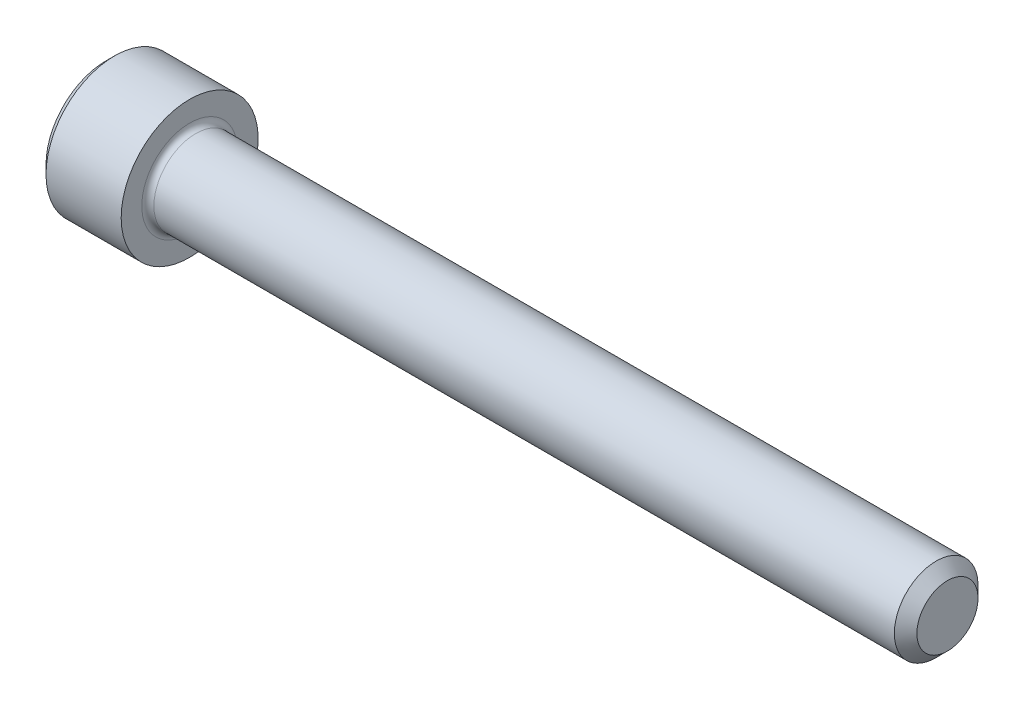
ISO-10303-21;
HEADER;
FILE_DESCRIPTION(('STEP AP214'),'2;1');
FILE_NAME('part.step','',(''),(''),'','','');
FILE_SCHEMA(('AUTOMOTIVE_DESIGN { 1 0 10303 214 1 1 1 1 }'));
ENDSEC;
DATA;
#1=APPLICATION_CONTEXT('core data for automotive mechanical design processes');
#2=APPLICATION_PROTOCOL_DEFINITION('international standard','automotive_design',2000,#1);
#3=PRODUCT_CONTEXT('',#1,'mechanical');
#4=PRODUCT('Part','Part','',(#3));
#5=PRODUCT_RELATED_PRODUCT_CATEGORY('part','',(#4));
#6=PRODUCT_DEFINITION_FORMATION('','',#4);
#7=PRODUCT_DEFINITION_CONTEXT('part definition',#1,'design');
#8=PRODUCT_DEFINITION('design','',#6,#7);
#9=PRODUCT_DEFINITION_SHAPE('','',#8);
#10=(LENGTH_UNIT() NAMED_UNIT(*) SI_UNIT(.MILLI.,.METRE.));
#11=(NAMED_UNIT(*) PLANE_ANGLE_UNIT() SI_UNIT($,.RADIAN.));
#12=(NAMED_UNIT(*) SI_UNIT($,.STERADIAN.) SOLID_ANGLE_UNIT());
#13=UNCERTAINTY_MEASURE_WITH_UNIT(LENGTH_MEASURE(1.E-05),#10,'distance_accuracy_value','');
#14=(GEOMETRIC_REPRESENTATION_CONTEXT(3) GLOBAL_UNCERTAINTY_ASSIGNED_CONTEXT((#13)) GLOBAL_UNIT_ASSIGNED_CONTEXT((#10,
#11,#12)) REPRESENTATION_CONTEXT('',''));
#15=CARTESIAN_POINT('',(0.,0.,0.));
#16=DIRECTION('',(0.,0.,1.));
#17=DIRECTION('',(1.,0.,0.));
#18=AXIS2_PLACEMENT_3D('',#15,#16,#17);
#19=CARTESIAN_POINT('',(0.,0.,0.));
#20=DIRECTION('',(-1.,0.,0.));
#21=DIRECTION('',(0.,0.,1.));
#22=AXIS2_PLACEMENT_3D('',#19,#20,#21);
#23=PLANE('',#22);
#24=DIRECTION('',(0.,-0.499999999999999,0.866025403784439));
#25=VECTOR('',#24,1.);
#26=CARTESIAN_POINT('',(0.,1.5984519552784,0.));
#27=LINE('',#26,#25);
#28=CARTESIAN_POINT('',(0.,1.5984519552784,0.));
#29=VERTEX_POINT('',#28);
#30=CARTESIAN_POINT('',(0.,0.799225977639205,1.3843));
#31=VERTEX_POINT('',#30);
#32=EDGE_CURVE('E384',#29,#31,#27,.T.);
#33=ORIENTED_EDGE('',*,*,#32,.T.);
#34=DIRECTION('',(0.,1.,0.));
#35=VECTOR('',#34,1.);
#36=CARTESIAN_POINT('',(0.,-0.799225977639191,1.3843));
#37=LINE('',#36,#35);
#38=CARTESIAN_POINT('',(0.,-0.799225977639191,1.3843));
#39=VERTEX_POINT('',#38);
#40=EDGE_CURVE('E128',#39,#31,#37,.T.);
#41=ORIENTED_EDGE('',*,*,#40,.F.);
#42=DIRECTION('',(0.,-0.500000000000001,-0.866025403784438));
#43=VECTOR('',#42,1.);
#44=CARTESIAN_POINT('',(0.,-0.799225977639191,1.3843));
#45=LINE('',#44,#43);
#46=CARTESIAN_POINT('',(0.,-1.59845195527839,0.));
#47=VERTEX_POINT('',#46);
#48=EDGE_CURVE('E387',#39,#47,#45,.T.);
#49=ORIENTED_EDGE('',*,*,#48,.T.);
#50=DIRECTION('',(0.,0.499999999999999,-0.86602540378444));
#51=VECTOR('',#50,1.);
#52=CARTESIAN_POINT('',(0.,-1.59845195527839,0.));
#53=LINE('',#52,#51);
#54=CARTESIAN_POINT('',(0.,-0.799225977639196,-1.3843));
#55=VERTEX_POINT('',#54);
#56=EDGE_CURVE('E390',#47,#55,#53,.T.);
#57=ORIENTED_EDGE('',*,*,#56,.T.);
#58=DIRECTION('',(0.,-1.,0.));
#59=VECTOR('',#58,1.);
#60=CARTESIAN_POINT('',(0.,0.799225977639202,-1.3843));
#61=LINE('',#60,#59);
#62=CARTESIAN_POINT('',(0.,0.799225977639202,-1.3843));
#63=VERTEX_POINT('',#62);
#64=EDGE_CURVE('E393',#63,#55,#61,.T.);
#65=ORIENTED_EDGE('',*,*,#64,.F.);
#66=DIRECTION('',(0.,-0.500000000000001,-0.866025403784438));
#67=VECTOR('',#66,1.);
#68=CARTESIAN_POINT('',(0.,1.5984519552784,0.));
#69=LINE('',#68,#67);
#70=EDGE_CURVE('E123',#29,#63,#69,.T.);
#71=ORIENTED_EDGE('',*,*,#70,.F.);
#72=EDGE_LOOP('',(#33,#41,#49,#57,#65,#71));
#73=FACE_BOUND('',#72,.T.);
#74=CARTESIAN_POINT('',(0.,0.,0.));
#75=DIRECTION('',(-1.,0.,0.));
#76=DIRECTION('',(0.,0.,1.));
#77=AXIS2_PLACEMENT_3D('',#74,#75,#76);
#78=CIRCLE('',#77,2.51460000000001);
#79=CARTESIAN_POINT('',(0.,0.,2.51460000000001));
#80=VERTEX_POINT('',#79);
#81=EDGE_CURVE('E139',#80,#80,#78,.T.);
#82=ORIENTED_EDGE('',*,*,#81,.T.);
#83=EDGE_LOOP('',(#82));
#84=FACE_BOUND('',#83,.T.);
#85=ADVANCED_FACE('F32',(#73,#84),#23,.T.);
#86=CARTESIAN_POINT('',(35.2552,1.28016,0.));
#87=DIRECTION('',(1.,0.,0.));
#88=DIRECTION('',(0.,0.,-1.));
#89=AXIS2_PLACEMENT_3D('',#86,#87,#88);
#90=PLANE('',#89);
#91=CARTESIAN_POINT('',(35.2552,0.,0.));
#92=DIRECTION('',(-1.,0.,0.));
#93=DIRECTION('',(0.,0.,1.));
#94=AXIS2_PLACEMENT_3D('',#91,#92,#93);
#95=CIRCLE('',#94,1.28016);
#96=CARTESIAN_POINT('',(35.2552,0.,1.28016));
#97=VERTEX_POINT('',#96);
#98=EDGE_CURVE('E152',#97,#97,#95,.T.);
#99=ORIENTED_EDGE('',*,*,#98,.F.);
#100=EDGE_LOOP('',(#99));
#101=FACE_BOUND('',#100,.T.);
#102=ADVANCED_FACE('F173',(#101),#90,.T.);
#103=CARTESIAN_POINT('',(35.2552,0.,0.));
#104=DIRECTION('',(-1.,0.,0.));
#105=DIRECTION('',(0.,0.,1.));
#106=AXIS2_PLACEMENT_3D('',#103,#104,#105);
#107=CONICAL_SURFACE('',#106,1.28016,0.785398163397457);
#108=CARTESIAN_POINT('',(34.78276,0.,0.));
#109=DIRECTION('',(-1.,0.,0.));
#110=DIRECTION('',(0.,0.,1.));
#111=AXIS2_PLACEMENT_3D('',#108,#109,#110);
#112=CIRCLE('',#111,1.7526);
#113=CARTESIAN_POINT('',(34.78276,0.,1.7526));
#114=VERTEX_POINT('',#113);
#115=EDGE_CURVE('E149',#114,#114,#112,.T.);
#116=ORIENTED_EDGE('',*,*,#115,.F.);
#117=EDGE_LOOP('',(#116));
#118=FACE_BOUND('',#117,.T.);
#119=ORIENTED_EDGE('',*,*,#98,.T.);
#120=EDGE_LOOP('',(#119));
#121=FACE_BOUND('',#120,.T.);
#122=ADVANCED_FACE('F179',(#118,#121),#107,.T.);
#123=CARTESIAN_POINT('',(-31.75,0.,0.));
#124=DIRECTION('',(-1.,0.,0.));
#125=DIRECTION('',(0.,0.,1.));
#126=AXIS2_PLACEMENT_3D('',#123,#124,#125);
#127=CYLINDRICAL_SURFACE('',#126,1.7526);
#128=CARTESIAN_POINT('',(3.7592,0.,0.));
#129=DIRECTION('',(1.,0.,0.));
#130=DIRECTION('',(0.,0.,-1.));
#131=AXIS2_PLACEMENT_3D('',#128,#129,#130);
#132=CIRCLE('',#131,1.7526);
#133=CARTESIAN_POINT('',(3.7592,0.,-1.7526));
#134=VERTEX_POINT('',#133);
#135=EDGE_CURVE('E11',#134,#134,#132,.T.);
#136=ORIENTED_EDGE('',*,*,#135,.T.);
#137=EDGE_LOOP('',(#136));
#138=FACE_BOUND('',#137,.T.);
#139=ORIENTED_EDGE('',*,*,#115,.T.);
#140=EDGE_LOOP('',(#139));
#141=FACE_BOUND('',#140,.T.);
#142=ADVANCED_FACE('F190',(#138,#141),#127,.T.);
#143=CARTESIAN_POINT('',(3.5052,2.8702,0.));
#144=DIRECTION('',(1.,0.,0.));
#145=DIRECTION('',(0.,0.,-1.));
#146=AXIS2_PLACEMENT_3D('',#143,#144,#145);
#147=PLANE('',#146);
#148=CARTESIAN_POINT('',(3.5052,0.,0.));
#149=DIRECTION('',(1.,0.,0.));
#150=DIRECTION('',(0.,0.,-1.));
#151=AXIS2_PLACEMENT_3D('',#148,#149,#150);
#152=CIRCLE('',#151,2.0066);
#153=CARTESIAN_POINT('',(3.5052,0.,-2.0066));
#154=VERTEX_POINT('',#153);
#155=EDGE_CURVE('E40',#154,#154,#152,.F.);
#156=ORIENTED_EDGE('',*,*,#155,.T.);
#157=EDGE_LOOP('',(#156));
#158=FACE_BOUND('',#157,.T.);
#159=CARTESIAN_POINT('',(3.5052,0.,0.));
#160=DIRECTION('',(-1.,0.,0.));
#161=DIRECTION('',(0.,0.,1.));
#162=AXIS2_PLACEMENT_3D('',#159,#160,#161);
#163=CIRCLE('',#162,2.8702);
#164=CARTESIAN_POINT('',(3.5052,0.,2.8702));
#165=VERTEX_POINT('',#164);
#166=EDGE_CURVE('E146',#165,#165,#163,.T.);
#167=ORIENTED_EDGE('',*,*,#166,.F.);
#168=EDGE_LOOP('',(#167));
#169=FACE_BOUND('',#168,.T.);
#170=ADVANCED_FACE('F157',(#158,#169),#147,.T.);
#171=CARTESIAN_POINT('',(-31.75,0.,0.));
#172=DIRECTION('',(-1.,0.,0.));
#173=DIRECTION('',(0.,0.,1.));
#174=AXIS2_PLACEMENT_3D('',#171,#172,#173);
#175=CYLINDRICAL_SURFACE('',#174,2.8702);
#176=ORIENTED_EDGE('',*,*,#166,.T.);
#177=EDGE_LOOP('',(#176));
#178=FACE_BOUND('',#177,.T.);
#179=CARTESIAN_POINT('',(0.355600000000005,0.,0.));
#180=DIRECTION('',(-1.,0.,0.));
#181=DIRECTION('',(0.,0.,1.));
#182=AXIS2_PLACEMENT_3D('',#179,#180,#181);
#183=CIRCLE('',#182,2.8702);
#184=CARTESIAN_POINT('',(0.355600000000005,0.,2.8702));
#185=VERTEX_POINT('',#184);
#186=EDGE_CURVE('E143',#185,#185,#183,.T.);
#187=ORIENTED_EDGE('',*,*,#186,.F.);
#188=EDGE_LOOP('',(#187));
#189=FACE_BOUND('',#188,.T.);
#190=ADVANCED_FACE('F168',(#178,#189),#175,.T.);
#191=CARTESIAN_POINT('',(0.,0.,0.));
#192=DIRECTION('',(1.,0.,0.));
#193=DIRECTION('',(0.,0.,-1.));
#194=AXIS2_PLACEMENT_3D('',#191,#192,#193);
#195=CONICAL_SURFACE('',#194,2.51460000000001,0.785398163397436);
#196=ORIENTED_EDGE('',*,*,#186,.T.);
#197=EDGE_LOOP('',(#196));
#198=FACE_BOUND('',#197,.T.);
#199=ORIENTED_EDGE('',*,*,#81,.F.);
#200=EDGE_LOOP('',(#199));
#201=FACE_BOUND('',#200,.T.);
#202=ADVANCED_FACE('F161',(#198,#201),#195,.T.);
#203=CARTESIAN_POINT('',(3.7592,0.,0.));
#204=DIRECTION('',(1.,0.,0.));
#205=DIRECTION('',(0.,0.,-1.));
#206=AXIS2_PLACEMENT_3D('',#203,#204,#205);
#207=TOROIDAL_SURFACE('',#206,2.0066,0.254);
#208=ORIENTED_EDGE('',*,*,#135,.F.);
#209=EDGE_LOOP('',(#208));
#210=FACE_BOUND('',#209,.T.);
#211=ORIENTED_EDGE('',*,*,#155,.F.);
#212=EDGE_LOOP('',(#211));
#213=FACE_BOUND('',#212,.T.);
#214=ADVANCED_FACE('F34',(#210,#213),#207,.F.);
#215=CARTESIAN_POINT('',(1.6256,1.5984519552784,0.));
#216=DIRECTION('',(0.,-0.866025403784439,-0.499999999999999));
#217=DIRECTION('',(0.,0.499999999999999,-0.866025403784439));
#218=AXIS2_PLACEMENT_3D('',#215,#216,#217);
#219=PLANE('',#218);
#220=ORIENTED_EDGE('',*,*,#32,.F.);
#221=DIRECTION('',(-1.,0.,0.));
#222=VECTOR('',#221,1.);
#223=CARTESIAN_POINT('',(1.6256,1.5984519552784,0.));
#224=LINE('',#223,#222);
#225=CARTESIAN_POINT('',(1.6256,1.5984519552784,0.));
#226=VERTEX_POINT('',#225);
#227=EDGE_CURVE('E374',#226,#29,#224,.T.);
#228=ORIENTED_EDGE('',*,*,#227,.F.);
#229=DIRECTION('',(0.,-0.499999999999999,0.866025403784439));
#230=VECTOR('',#229,1.);
#231=CARTESIAN_POINT('',(1.6256,1.5984519552784,0.));
#232=LINE('',#231,#230);
#233=CARTESIAN_POINT('',(1.6256,1.1988389664588,0.692150000000001));
#234=VERTEX_POINT('',#233);
#235=EDGE_CURVE('E115',#226,#234,#232,.T.);
#236=ORIENTED_EDGE('',*,*,#235,.T.);
#237=CARTESIAN_POINT('',(1.6256,0.799225977639205,1.3843));
#238=VERTEX_POINT('',#237);
#239=EDGE_CURVE('E106',#234,#238,#232,.T.);
#240=ORIENTED_EDGE('',*,*,#239,.T.);
#241=DIRECTION('',(-1.,0.,0.));
#242=VECTOR('',#241,1.);
#243=CARTESIAN_POINT('',(1.6256,0.799225977639205,1.3843));
#244=LINE('',#243,#242);
#245=EDGE_CURVE('E120',#238,#31,#244,.T.);
#246=ORIENTED_EDGE('',*,*,#245,.T.);
#247=EDGE_LOOP('',(#220,#228,#236,#240,#246));
#248=FACE_BOUND('',#247,.T.);
#249=ADVANCED_FACE('F119',(#248),#219,.T.);
#250=CARTESIAN_POINT('',(1.6256,-0.799225977639191,1.3843));
#251=DIRECTION('',(0.,0.,1.));
#252=DIRECTION('',(0.,-1.,0.));
#253=AXIS2_PLACEMENT_3D('',#250,#251,#252);
#254=PLANE('',#253);
#255=ORIENTED_EDGE('',*,*,#40,.T.);
#256=ORIENTED_EDGE('',*,*,#245,.F.);
#257=DIRECTION('',(0.,1.,0.));
#258=VECTOR('',#257,1.);
#259=CARTESIAN_POINT('',(1.6256,-0.799225977639191,1.3843));
#260=LINE('',#259,#258);
#261=CARTESIAN_POINT('',(1.6256,0.,1.3843));
#262=VERTEX_POINT('',#261);
#263=EDGE_CURVE('E103',#262,#238,#260,.T.);
#264=ORIENTED_EDGE('',*,*,#263,.F.);
#265=CARTESIAN_POINT('',(1.6256,-0.799225977639191,1.3843));
#266=VERTEX_POINT('',#265);
#267=EDGE_CURVE('E114',#266,#262,#260,.T.);
#268=ORIENTED_EDGE('',*,*,#267,.F.);
#269=DIRECTION('',(-1.,0.,0.));
#270=VECTOR('',#269,1.);
#271=CARTESIAN_POINT('',(1.6256,-0.799225977639191,1.3843));
#272=LINE('',#271,#270);
#273=EDGE_CURVE('E130',#266,#39,#272,.T.);
#274=ORIENTED_EDGE('',*,*,#273,.T.);
#275=EDGE_LOOP('',(#255,#256,#264,#268,#274));
#276=FACE_BOUND('',#275,.T.);
#277=ADVANCED_FACE('F125',(#276),#254,.F.);
#278=CARTESIAN_POINT('',(1.6256,-0.799225977639191,1.3843));
#279=DIRECTION('',(0.,0.866025403784438,-0.500000000000001));
#280=DIRECTION('',(0.,0.500000000000001,0.866025403784438));
#281=AXIS2_PLACEMENT_3D('',#278,#279,#280);
#282=PLANE('',#281);
#283=ORIENTED_EDGE('',*,*,#48,.F.);
#284=ORIENTED_EDGE('',*,*,#273,.F.);
#285=DIRECTION('',(0.,-0.500000000000001,-0.866025403784438));
#286=VECTOR('',#285,1.);
#287=CARTESIAN_POINT('',(1.6256,-0.799225977639191,1.3843));
#288=LINE('',#287,#286);
#289=CARTESIAN_POINT('',(1.6256,-1.19883896645879,0.692149999999999));
#290=VERTEX_POINT('',#289);
#291=EDGE_CURVE('E413',#266,#290,#288,.T.);
#292=ORIENTED_EDGE('',*,*,#291,.T.);
#293=CARTESIAN_POINT('',(1.6256,-1.59845195527839,0.));
#294=VERTEX_POINT('',#293);
#295=EDGE_CURVE('E402',#290,#294,#288,.T.);
#296=ORIENTED_EDGE('',*,*,#295,.T.);
#297=DIRECTION('',(-1.,0.,0.));
#298=VECTOR('',#297,1.);
#299=CARTESIAN_POINT('',(1.6256,-1.59845195527839,0.));
#300=LINE('',#299,#298);
#301=EDGE_CURVE('E135',#294,#47,#300,.T.);
#302=ORIENTED_EDGE('',*,*,#301,.T.);
#303=EDGE_LOOP('',(#283,#284,#292,#296,#302));
#304=FACE_BOUND('',#303,.T.);
#305=ADVANCED_FACE('F265',(#304),#282,.T.);
#306=CARTESIAN_POINT('',(1.6256,-1.59845195527839,0.));
#307=DIRECTION('',(0.,0.866025403784439,0.499999999999999));
#308=DIRECTION('',(0.,-0.499999999999999,0.866025403784439));
#309=AXIS2_PLACEMENT_3D('',#306,#307,#308);
#310=PLANE('',#309);
#311=ORIENTED_EDGE('',*,*,#56,.F.);
#312=ORIENTED_EDGE('',*,*,#301,.F.);
#313=DIRECTION('',(0.,0.499999999999999,-0.86602540378444));
#314=VECTOR('',#313,1.);
#315=CARTESIAN_POINT('',(1.6256,-1.59845195527839,0.));
#316=LINE('',#315,#314);
#317=CARTESIAN_POINT('',(1.6256,-1.1988389664588,-0.692149999999996));
#318=VERTEX_POINT('',#317);
#319=EDGE_CURVE('E380',#294,#318,#316,.T.);
#320=ORIENTED_EDGE('',*,*,#319,.T.);
#321=CARTESIAN_POINT('',(1.6256,-0.799225977639196,-1.3843));
#322=VERTEX_POINT('',#321);
#323=EDGE_CURVE('E412',#318,#322,#316,.T.);
#324=ORIENTED_EDGE('',*,*,#323,.T.);
#325=DIRECTION('',(-1.,0.,0.));
#326=VECTOR('',#325,1.);
#327=CARTESIAN_POINT('',(1.6256,-0.799225977639196,-1.3843));
#328=LINE('',#327,#326);
#329=EDGE_CURVE('E373',#322,#55,#328,.T.);
#330=ORIENTED_EDGE('',*,*,#329,.T.);
#331=EDGE_LOOP('',(#311,#312,#320,#324,#330));
#332=FACE_BOUND('',#331,.T.);
#333=ADVANCED_FACE('F273',(#332),#310,.T.);
#334=CARTESIAN_POINT('',(1.6256,0.799225977639202,-1.3843));
#335=DIRECTION('',(0.,0.,-1.));
#336=DIRECTION('',(0.,1.,0.));
#337=AXIS2_PLACEMENT_3D('',#334,#335,#336);
#338=PLANE('',#337);
#339=ORIENTED_EDGE('',*,*,#64,.T.);
#340=ORIENTED_EDGE('',*,*,#329,.F.);
#341=DIRECTION('',(0.,-1.,0.));
#342=VECTOR('',#341,1.);
#343=CARTESIAN_POINT('',(1.6256,0.799225977639202,-1.3843));
#344=LINE('',#343,#342);
#345=CARTESIAN_POINT('',(1.6256,0.,-1.3843));
#346=VERTEX_POINT('',#345);
#347=EDGE_CURVE('E377',#346,#322,#344,.T.);
#348=ORIENTED_EDGE('',*,*,#347,.F.);
#349=CARTESIAN_POINT('',(1.6256,0.799225977639202,-1.3843));
#350=VERTEX_POINT('',#349);
#351=EDGE_CURVE('E47',#350,#346,#344,.T.);
#352=ORIENTED_EDGE('',*,*,#351,.F.);
#353=DIRECTION('',(-1.,0.,0.));
#354=VECTOR('',#353,1.);
#355=CARTESIAN_POINT('',(1.6256,0.799225977639202,-1.3843));
#356=LINE('',#355,#354);
#357=EDGE_CURVE('E370',#350,#63,#356,.T.);
#358=ORIENTED_EDGE('',*,*,#357,.T.);
#359=EDGE_LOOP('',(#339,#340,#348,#352,#358));
#360=FACE_BOUND('',#359,.T.);
#361=ADVANCED_FACE('F282',(#360),#338,.F.);
#362=CARTESIAN_POINT('',(1.6256,1.5984519552784,0.));
#363=DIRECTION('',(0.,0.866025403784438,-0.500000000000001));
#364=DIRECTION('',(0.,0.500000000000001,0.866025403784438));
#365=AXIS2_PLACEMENT_3D('',#362,#363,#364);
#366=PLANE('',#365);
#367=ORIENTED_EDGE('',*,*,#70,.T.);
#368=ORIENTED_EDGE('',*,*,#357,.F.);
#369=DIRECTION('',(0.,-0.500000000000001,-0.866025403784438));
#370=VECTOR('',#369,1.);
#371=CARTESIAN_POINT('',(1.6256,1.5984519552784,0.));
#372=LINE('',#371,#370);
#373=CARTESIAN_POINT('',(1.6256,1.1988389664588,-0.692150000000004));
#374=VERTEX_POINT('',#373);
#375=EDGE_CURVE('E360',#374,#350,#372,.T.);
#376=ORIENTED_EDGE('',*,*,#375,.F.);
#377=EDGE_CURVE('E366',#226,#374,#372,.T.);
#378=ORIENTED_EDGE('',*,*,#377,.F.);
#379=ORIENTED_EDGE('',*,*,#227,.T.);
#380=EDGE_LOOP('',(#367,#368,#376,#378,#379));
#381=FACE_BOUND('',#380,.T.);
#382=ADVANCED_FACE('F291',(#381),#366,.F.);
#383=CARTESIAN_POINT('',(1.6256,0.,2.7686));
#384=DIRECTION('',(1.,0.,0.));
#385=DIRECTION('',(0.,0.,-1.));
#386=AXIS2_PLACEMENT_3D('',#383,#384,#385);
#387=PLANE('',#386);
#388=ORIENTED_EDGE('',*,*,#347,.T.);
#389=ORIENTED_EDGE('',*,*,#323,.F.);
#390=CARTESIAN_POINT('',(1.6256,0.,0.));
#391=DIRECTION('',(-1.,0.,0.));
#392=DIRECTION('',(0.,0.,1.));
#393=AXIS2_PLACEMENT_3D('',#390,#391,#392);
#394=CIRCLE('',#393,1.3843);
#395=EDGE_CURVE('E408',#346,#318,#394,.T.);
#396=ORIENTED_EDGE('',*,*,#395,.F.);
#397=EDGE_LOOP('',(#388,#389,#396));
#398=FACE_BOUND('',#397,.T.);
#399=ADVANCED_FACE('F300',(#398),#387,.F.);
#400=ORIENTED_EDGE('',*,*,#319,.F.);
#401=ORIENTED_EDGE('',*,*,#295,.F.);
#402=EDGE_CURVE('E133',#318,#290,#394,.T.);
#403=ORIENTED_EDGE('',*,*,#402,.F.);
#404=EDGE_LOOP('',(#400,#401,#403));
#405=FACE_BOUND('',#404,.T.);
#406=ADVANCED_FACE('F309',(#405),#387,.F.);
#407=ORIENTED_EDGE('',*,*,#291,.F.);
#408=ORIENTED_EDGE('',*,*,#267,.T.);
#409=EDGE_CURVE('E129',#290,#262,#394,.T.);
#410=ORIENTED_EDGE('',*,*,#409,.F.);
#411=EDGE_LOOP('',(#407,#408,#410));
#412=FACE_BOUND('',#411,.T.);
#413=ADVANCED_FACE('F318',(#412),#387,.F.);
#414=ORIENTED_EDGE('',*,*,#263,.T.);
#415=ORIENTED_EDGE('',*,*,#239,.F.);
#416=EDGE_CURVE('E109',#262,#234,#394,.T.);
#417=ORIENTED_EDGE('',*,*,#416,.F.);
#418=EDGE_LOOP('',(#414,#415,#417));
#419=FACE_BOUND('',#418,.T.);
#420=ADVANCED_FACE('F105',(#419),#387,.F.);
#421=ORIENTED_EDGE('',*,*,#235,.F.);
#422=ORIENTED_EDGE('',*,*,#377,.T.);
#423=EDGE_CURVE('E140',#234,#374,#394,.T.);
#424=ORIENTED_EDGE('',*,*,#423,.F.);
#425=EDGE_LOOP('',(#421,#422,#424));
#426=FACE_BOUND('',#425,.T.);
#427=ADVANCED_FACE('F333',(#426),#387,.F.);
#428=ORIENTED_EDGE('',*,*,#375,.T.);
#429=ORIENTED_EDGE('',*,*,#351,.T.);
#430=EDGE_CURVE('E363',#374,#346,#394,.T.);
#431=ORIENTED_EDGE('',*,*,#430,.F.);
#432=EDGE_LOOP('',(#428,#429,#431));
#433=FACE_BOUND('',#432,.T.);
#434=ADVANCED_FACE('F248',(#433),#387,.F.);
#435=CARTESIAN_POINT('',(1.6256,0.,0.));
#436=DIRECTION('',(-1.,0.,0.));
#437=DIRECTION('',(0.,0.,1.));
#438=AXIS2_PLACEMENT_3D('',#435,#436,#437);
#439=CONICAL_SURFACE('',#438,1.3843,1.04719755119659);
#440=CARTESIAN_POINT('',(2.4248259776392,0.,0.));
#441=VERTEX_POINT('',#440);
#442=VERTEX_LOOP('',#441);
#443=FACE_BOUND('',#442,.T.);
#444=ORIENTED_EDGE('',*,*,#416,.T.);
#445=ORIENTED_EDGE('',*,*,#423,.T.);
#446=ORIENTED_EDGE('',*,*,#430,.T.);
#447=ORIENTED_EDGE('',*,*,#395,.T.);
#448=ORIENTED_EDGE('',*,*,#402,.T.);
#449=ORIENTED_EDGE('',*,*,#409,.T.);
#450=EDGE_LOOP('',(#444,#445,#446,#447,#448,#449));
#451=FACE_BOUND('',#450,.T.);
#452=ADVANCED_FACE('F183',(#443,#451),#439,.F.);
#453=CLOSED_SHELL('',(#85,#102,#122,#142,#170,#190,#202,#214,#249,#277,#305,#333,#361,#382,#399,
#406,#413,#420,#427,#434,#452));
#454=MANIFOLD_SOLID_BREP('B2',#453);
#455=ADVANCED_BREP_SHAPE_REPRESENTATION('',(#18,#454),#14);
#456=SHAPE_DEFINITION_REPRESENTATION(#9,#455);
ENDSEC;
END-ISO-10303-21;
